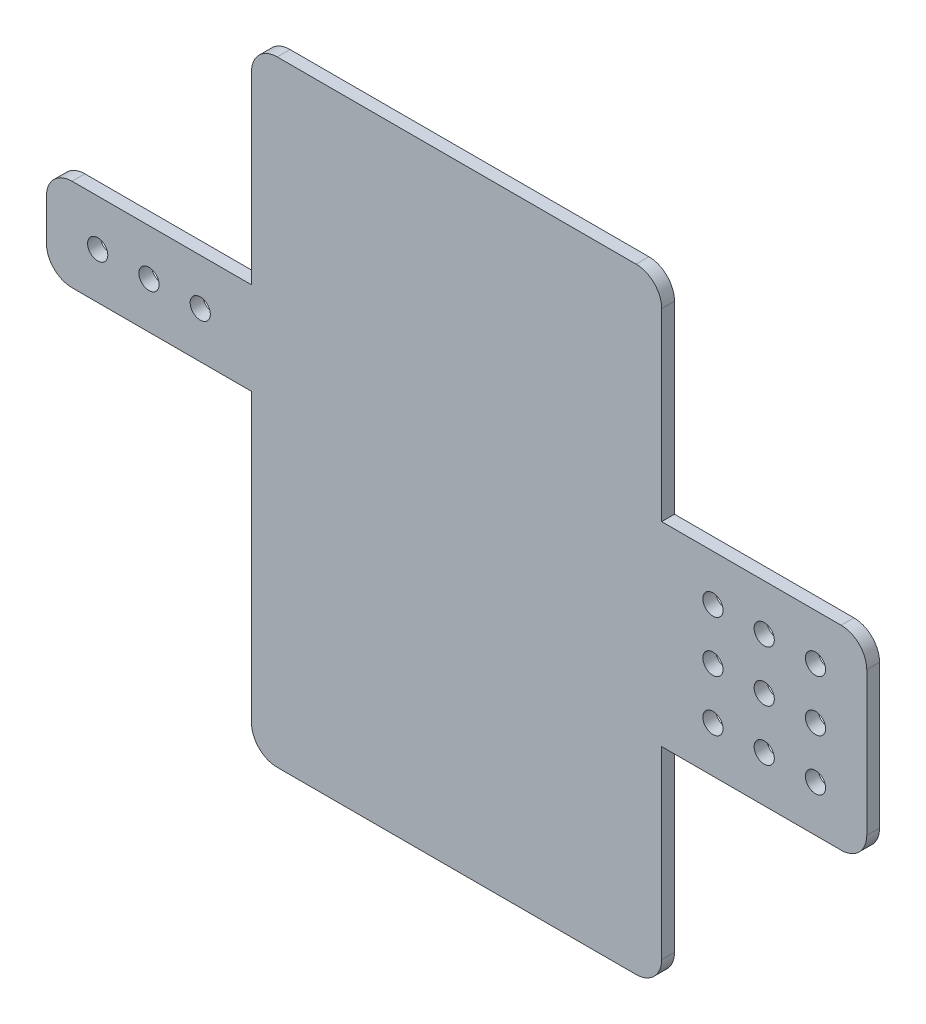
ISO-10303-21;
HEADER;
FILE_DESCRIPTION(('STEP AP214'),'2;1');
FILE_NAME('part.step','',(''),(''),'','','');
FILE_SCHEMA(('AUTOMOTIVE_DESIGN { 1 0 10303 214 1 1 1 1 }'));
ENDSEC;
DATA;
#1=APPLICATION_CONTEXT('core data for automotive mechanical design processes');
#2=APPLICATION_PROTOCOL_DEFINITION('international standard','automotive_design',2000,#1);
#3=PRODUCT_CONTEXT('',#1,'mechanical');
#4=PRODUCT('Part','Part','',(#3));
#5=PRODUCT_RELATED_PRODUCT_CATEGORY('part','',(#4));
#6=PRODUCT_DEFINITION_FORMATION('','',#4);
#7=PRODUCT_DEFINITION_CONTEXT('part definition',#1,'design');
#8=PRODUCT_DEFINITION('design','',#6,#7);
#9=PRODUCT_DEFINITION_SHAPE('','',#8);
#10=(LENGTH_UNIT() NAMED_UNIT(*) SI_UNIT(.MILLI.,.METRE.));
#11=(NAMED_UNIT(*) PLANE_ANGLE_UNIT() SI_UNIT($,.RADIAN.));
#12=(NAMED_UNIT(*) SI_UNIT($,.STERADIAN.) SOLID_ANGLE_UNIT());
#13=UNCERTAINTY_MEASURE_WITH_UNIT(LENGTH_MEASURE(1.E-05),#10,'distance_accuracy_value','');
#14=(GEOMETRIC_REPRESENTATION_CONTEXT(3) GLOBAL_UNCERTAINTY_ASSIGNED_CONTEXT((#13)) GLOBAL_UNIT_ASSIGNED_CONTEXT((#10,
#11,#12)) REPRESENTATION_CONTEXT('',''));
#15=CARTESIAN_POINT('',(0.,0.,0.));
#16=DIRECTION('',(0.,0.,1.));
#17=DIRECTION('',(1.,0.,0.));
#18=AXIS2_PLACEMENT_3D('',#15,#16,#17);
#19=CARTESIAN_POINT('',(0.,25.1030959893067,3.175));
#20=DIRECTION('',(0.,1.,0.));
#21=DIRECTION('',(0.,0.,1.));
#22=AXIS2_PLACEMENT_3D('',#19,#20,#21);
#23=PLANE('',#22);
#24=DIRECTION('',(1.,0.,0.));
#25=VECTOR('',#24,1.);
#26=CARTESIAN_POINT('',(0.,25.1030959893067,0.));
#27=LINE('',#26,#25);
#28=CARTESIAN_POINT('',(-125.176151207656,25.1030959893067,0.));
#29=VERTEX_POINT('',#28);
#30=CARTESIAN_POINT('',(-36.2761512076566,25.1030959893067,0.));
#31=VERTEX_POINT('',#30);
#32=EDGE_CURVE('E354',#29,#31,#27,.T.);
#33=ORIENTED_EDGE('',*,*,#32,.F.);
#34=DIRECTION('',(0.,0.,-1.));
#35=VECTOR('',#34,1.);
#36=CARTESIAN_POINT('',(-125.176151207656,25.1030959893067,3.175));
#37=LINE('',#36,#35);
#38=CARTESIAN_POINT('',(-125.176151207656,25.1030959893067,3.175));
#39=VERTEX_POINT('',#38);
#40=EDGE_CURVE('E11',#39,#29,#37,.T.);
#41=ORIENTED_EDGE('',*,*,#40,.F.);
#42=DIRECTION('',(1.,0.,0.));
#43=VECTOR('',#42,1.);
#44=CARTESIAN_POINT('',(0.,25.1030959893067,3.175));
#45=LINE('',#44,#43);
#46=CARTESIAN_POINT('',(-36.2761512076566,25.1030959893067,3.175));
#47=VERTEX_POINT('',#46);
#48=EDGE_CURVE('E255',#39,#47,#45,.T.);
#49=ORIENTED_EDGE('',*,*,#48,.T.);
#50=DIRECTION('',(0.,0.,-1.));
#51=VECTOR('',#50,1.);
#52=CARTESIAN_POINT('',(-36.2761512076566,25.1030959893067,3.175));
#53=LINE('',#52,#51);
#54=EDGE_CURVE('E58',#47,#31,#53,.T.);
#55=ORIENTED_EDGE('',*,*,#54,.T.);
#56=EDGE_LOOP('',(#33,#41,#49,#55));
#57=FACE_BOUND('',#56,.T.);
#58=ADVANCED_FACE('F41',(#57),#23,.T.);
#59=CARTESIAN_POINT('',(-125.176151207657,18.7530959893067,3.175));
#60=DIRECTION('',(0.,0.,-1.));
#61=DIRECTION('',(-1.,0.,0.));
#62=AXIS2_PLACEMENT_3D('',#59,#60,#61);
#63=CYLINDRICAL_SURFACE('',#62,6.35);
#64=CARTESIAN_POINT('',(-125.176151207657,18.7530959893067,0.));
#65=DIRECTION('',(0.,0.,1.));
#66=DIRECTION('',(1.,0.,0.));
#67=AXIS2_PLACEMENT_3D('',#64,#65,#66);
#68=CIRCLE('',#67,6.35);
#69=CARTESIAN_POINT('',(-131.526151207657,18.7530959893066,0.));
#70=VERTEX_POINT('',#69);
#71=EDGE_CURVE('E358',#29,#70,#68,.T.);
#72=ORIENTED_EDGE('',*,*,#71,.T.);
#73=DIRECTION('',(0.,0.,-1.));
#74=VECTOR('',#73,1.);
#75=CARTESIAN_POINT('',(-131.526151207657,18.7530959893066,3.175));
#76=LINE('',#75,#74);
#77=CARTESIAN_POINT('',(-131.526151207657,18.7530959893066,3.175));
#78=VERTEX_POINT('',#77);
#79=EDGE_CURVE('E50',#78,#70,#76,.T.);
#80=ORIENTED_EDGE('',*,*,#79,.F.);
#81=CARTESIAN_POINT('',(-125.176151207657,18.7530959893067,3.175));
#82=DIRECTION('',(0.,0.,1.));
#83=DIRECTION('',(1.,0.,0.));
#84=AXIS2_PLACEMENT_3D('',#81,#82,#83);
#85=CIRCLE('',#84,6.35);
#86=EDGE_CURVE('E252',#39,#78,#85,.T.);
#87=ORIENTED_EDGE('',*,*,#86,.F.);
#88=ORIENTED_EDGE('',*,*,#40,.T.);
#89=EDGE_LOOP('',(#72,#80,#87,#88));
#90=FACE_BOUND('',#89,.T.);
#91=ADVANCED_FACE('F500',(#90),#63,.T.);
#92=CARTESIAN_POINT('',(-131.526151207657,0.,3.175));
#93=DIRECTION('',(1.,0.,0.));
#94=DIRECTION('',(0.,1.,0.));
#95=AXIS2_PLACEMENT_3D('',#92,#93,#94);
#96=PLANE('',#95);
#97=DIRECTION('',(0.,-1.,0.));
#98=VECTOR('',#97,1.);
#99=CARTESIAN_POINT('',(-131.526151207657,0.,0.));
#100=LINE('',#99,#98);
#101=CARTESIAN_POINT('',(-131.526151207657,-26.9669040106933,0.));
#102=VERTEX_POINT('',#101);
#103=EDGE_CURVE('E364',#70,#102,#100,.T.);
#104=ORIENTED_EDGE('',*,*,#103,.T.);
#105=DIRECTION('',(0.,0.,-1.));
#106=VECTOR('',#105,1.);
#107=CARTESIAN_POINT('',(-131.526151207657,-26.9669040106933,3.175));
#108=LINE('',#107,#106);
#109=CARTESIAN_POINT('',(-131.526151207657,-26.9669040106933,3.175));
#110=VERTEX_POINT('',#109);
#111=EDGE_CURVE('E473',#110,#102,#108,.T.);
#112=ORIENTED_EDGE('',*,*,#111,.F.);
#113=DIRECTION('',(0.,-1.,0.));
#114=VECTOR('',#113,1.);
#115=CARTESIAN_POINT('',(-131.526151207657,0.,3.175));
#116=LINE('',#115,#114);
#117=EDGE_CURVE('E249',#78,#110,#116,.T.);
#118=ORIENTED_EDGE('',*,*,#117,.F.);
#119=ORIENTED_EDGE('',*,*,#79,.T.);
#120=EDGE_LOOP('',(#104,#112,#118,#119));
#121=FACE_BOUND('',#120,.T.);
#122=ADVANCED_FACE('F482',(#121),#96,.F.);
#123=CARTESIAN_POINT('',(0.,-26.9669040106933,3.175));
#124=DIRECTION('',(0.,-1.,0.));
#125=DIRECTION('',(1.,0.,0.));
#126=AXIS2_PLACEMENT_3D('',#123,#124,#125);
#127=PLANE('',#126);
#128=DIRECTION('',(-1.,0.,0.));
#129=VECTOR('',#128,1.);
#130=CARTESIAN_POINT('',(0.,-26.9669040106933,0.));
#131=LINE('',#130,#129);
#132=CARTESIAN_POINT('',(-175.976151207657,-26.9669040106933,0.));
#133=VERTEX_POINT('',#132);
#134=EDGE_CURVE('E369',#102,#133,#131,.T.);
#135=ORIENTED_EDGE('',*,*,#134,.T.);
#136=DIRECTION('',(0.,0.,-1.));
#137=VECTOR('',#136,1.);
#138=CARTESIAN_POINT('',(-175.976151207657,-26.9669040106933,3.175));
#139=LINE('',#138,#137);
#140=CARTESIAN_POINT('',(-175.976151207657,-26.9669040106933,3.175));
#141=VERTEX_POINT('',#140);
#142=EDGE_CURVE('E469',#141,#133,#139,.T.);
#143=ORIENTED_EDGE('',*,*,#142,.F.);
#144=DIRECTION('',(-1.,0.,0.));
#145=VECTOR('',#144,1.);
#146=CARTESIAN_POINT('',(0.,-26.9669040106933,3.175));
#147=LINE('',#146,#145);
#148=EDGE_CURVE('E246',#110,#141,#147,.T.);
#149=ORIENTED_EDGE('',*,*,#148,.F.);
#150=ORIENTED_EDGE('',*,*,#111,.T.);
#151=EDGE_LOOP('',(#135,#143,#149,#150));
#152=FACE_BOUND('',#151,.T.);
#153=ADVANCED_FACE('F491',(#152),#127,.F.);
#154=CARTESIAN_POINT('',(-175.976151207657,-33.3169040106933,3.175));
#155=DIRECTION('',(0.,0.,-1.));
#156=DIRECTION('',(-1.,0.,0.));
#157=AXIS2_PLACEMENT_3D('',#154,#155,#156);
#158=CYLINDRICAL_SURFACE('',#157,6.35);
#159=CARTESIAN_POINT('',(-175.976151207657,-33.3169040106933,0.));
#160=DIRECTION('',(0.,0.,1.));
#161=DIRECTION('',(1.,0.,0.));
#162=AXIS2_PLACEMENT_3D('',#159,#160,#161);
#163=CIRCLE('',#162,6.35);
#164=CARTESIAN_POINT('',(-182.326151207657,-33.3169040106933,0.));
#165=VERTEX_POINT('',#164);
#166=EDGE_CURVE('E373',#133,#165,#163,.T.);
#167=ORIENTED_EDGE('',*,*,#166,.T.);
#168=DIRECTION('',(0.,0.,-1.));
#169=VECTOR('',#168,1.);
#170=CARTESIAN_POINT('',(-182.326151207657,-33.3169040106933,3.175));
#171=LINE('',#170,#169);
#172=CARTESIAN_POINT('',(-182.326151207657,-33.3169040106933,3.175));
#173=VERTEX_POINT('',#172);
#174=EDGE_CURVE('E465',#173,#165,#171,.T.);
#175=ORIENTED_EDGE('',*,*,#174,.F.);
#176=CARTESIAN_POINT('',(-175.976151207657,-33.3169040106933,3.175));
#177=DIRECTION('',(0.,0.,1.));
#178=DIRECTION('',(1.,0.,0.));
#179=AXIS2_PLACEMENT_3D('',#176,#177,#178);
#180=CIRCLE('',#179,6.35);
#181=EDGE_CURVE('E243',#141,#173,#180,.T.);
#182=ORIENTED_EDGE('',*,*,#181,.F.);
#183=ORIENTED_EDGE('',*,*,#142,.T.);
#184=EDGE_LOOP('',(#167,#175,#182,#183));
#185=FACE_BOUND('',#184,.T.);
#186=ADVANCED_FACE('F495',(#185),#158,.T.);
#187=CARTESIAN_POINT('',(-182.326151207657,-4.98087330369164E-13,3.175));
#188=DIRECTION('',(1.,0.,0.));
#189=DIRECTION('',(0.,1.,0.));
#190=AXIS2_PLACEMENT_3D('',#187,#188,#189);
#191=PLANE('',#190);
#192=DIRECTION('',(0.,-1.,0.));
#193=VECTOR('',#192,1.);
#194=CARTESIAN_POINT('',(-182.326151207657,-4.98087330369164E-13,0.));
#195=LINE('',#194,#193);
#196=CARTESIAN_POINT('',(-182.326151207656,-43.4769040106933,0.));
#197=VERTEX_POINT('',#196);
#198=EDGE_CURVE('E376',#165,#197,#195,.T.);
#199=ORIENTED_EDGE('',*,*,#198,.T.);
#200=DIRECTION('',(0.,0.,-1.));
#201=VECTOR('',#200,1.);
#202=CARTESIAN_POINT('',(-182.326151207656,-43.4769040106933,3.175));
#203=LINE('',#202,#201);
#204=CARTESIAN_POINT('',(-182.326151207656,-43.4769040106933,3.175));
#205=VERTEX_POINT('',#204);
#206=EDGE_CURVE('E462',#205,#197,#203,.T.);
#207=ORIENTED_EDGE('',*,*,#206,.F.);
#208=DIRECTION('',(0.,-1.,0.));
#209=VECTOR('',#208,1.);
#210=CARTESIAN_POINT('',(-182.326151207657,-4.98087330369164E-13,3.175));
#211=LINE('',#210,#209);
#212=EDGE_CURVE('E240',#173,#205,#211,.T.);
#213=ORIENTED_EDGE('',*,*,#212,.F.);
#214=ORIENTED_EDGE('',*,*,#174,.T.);
#215=EDGE_LOOP('',(#199,#207,#213,#214));
#216=FACE_BOUND('',#215,.T.);
#217=ADVANCED_FACE('F513',(#216),#191,.F.);
#218=CARTESIAN_POINT('',(-175.976151207657,-43.4769040106933,3.175));
#219=DIRECTION('',(0.,0.,-1.));
#220=DIRECTION('',(-1.,0.,0.));
#221=AXIS2_PLACEMENT_3D('',#218,#219,#220);
#222=CYLINDRICAL_SURFACE('',#221,6.34999999999999);
#223=CARTESIAN_POINT('',(-175.976151207657,-43.4769040106933,0.));
#224=DIRECTION('',(0.,0.,1.));
#225=DIRECTION('',(1.,0.,0.));
#226=AXIS2_PLACEMENT_3D('',#223,#224,#225);
#227=CIRCLE('',#226,6.34999999999999);
#228=CARTESIAN_POINT('',(-175.976151207657,-49.8269040106933,0.));
#229=VERTEX_POINT('',#228);
#230=EDGE_CURVE('E380',#229,#197,#227,.F.);
#231=ORIENTED_EDGE('',*,*,#230,.F.);
#232=DIRECTION('',(0.,0.,-1.));
#233=VECTOR('',#232,1.);
#234=CARTESIAN_POINT('',(-175.976151207657,-49.8269040106933,3.175));
#235=LINE('',#234,#233);
#236=CARTESIAN_POINT('',(-175.976151207657,-49.8269040106933,3.175));
#237=VERTEX_POINT('',#236);
#238=EDGE_CURVE('E459',#237,#229,#235,.T.);
#239=ORIENTED_EDGE('',*,*,#238,.F.);
#240=CARTESIAN_POINT('',(-175.976151207657,-43.4769040106933,3.175));
#241=DIRECTION('',(0.,0.,1.));
#242=DIRECTION('',(1.,0.,0.));
#243=AXIS2_PLACEMENT_3D('',#240,#241,#242);
#244=CIRCLE('',#243,6.34999999999999);
#245=EDGE_CURVE('E236',#237,#205,#244,.F.);
#246=ORIENTED_EDGE('',*,*,#245,.T.);
#247=ORIENTED_EDGE('',*,*,#206,.T.);
#248=EDGE_LOOP('',(#231,#239,#246,#247));
#249=FACE_BOUND('',#248,.T.);
#250=ADVANCED_FACE('F516',(#249),#222,.T.);
#251=CARTESIAN_POINT('',(0.,-49.8269040106933,3.175));
#252=DIRECTION('',(0.,-1.,0.));
#253=DIRECTION('',(1.,0.,0.));
#254=AXIS2_PLACEMENT_3D('',#251,#252,#253);
#255=PLANE('',#254);
#256=DIRECTION('',(-1.,0.,0.));
#257=VECTOR('',#256,1.);
#258=CARTESIAN_POINT('',(0.,-49.8269040106933,0.));
#259=LINE('',#258,#257);
#260=CARTESIAN_POINT('',(-131.526151207657,-49.8269040106933,0.));
#261=VERTEX_POINT('',#260);
#262=EDGE_CURVE('E384',#261,#229,#259,.T.);
#263=ORIENTED_EDGE('',*,*,#262,.F.);
#264=DIRECTION('',(0.,0.,-1.));
#265=VECTOR('',#264,1.);
#266=CARTESIAN_POINT('',(-131.526151207657,-49.8269040106933,3.175));
#267=LINE('',#266,#265);
#268=CARTESIAN_POINT('',(-131.526151207657,-49.8269040106933,3.175));
#269=VERTEX_POINT('',#268);
#270=EDGE_CURVE('E456',#269,#261,#267,.T.);
#271=ORIENTED_EDGE('',*,*,#270,.F.);
#272=DIRECTION('',(-1.,0.,0.));
#273=VECTOR('',#272,1.);
#274=CARTESIAN_POINT('',(0.,-49.8269040106933,3.175));
#275=LINE('',#274,#273);
#276=EDGE_CURVE('E232',#269,#237,#275,.T.);
#277=ORIENTED_EDGE('',*,*,#276,.T.);
#278=ORIENTED_EDGE('',*,*,#238,.T.);
#279=EDGE_LOOP('',(#263,#271,#277,#278));
#280=FACE_BOUND('',#279,.T.);
#281=ADVANCED_FACE('F520',(#280),#255,.T.);
#282=CARTESIAN_POINT('',(-131.526151207657,-120.946904010693,0.));
#283=VERTEX_POINT('',#282);
#284=EDGE_CURVE('E370',#261,#283,#100,.T.);
#285=ORIENTED_EDGE('',*,*,#284,.T.);
#286=DIRECTION('',(0.,0.,-1.));
#287=VECTOR('',#286,1.);
#288=CARTESIAN_POINT('',(-131.526151207657,-120.946904010693,3.175));
#289=LINE('',#288,#287);
#290=CARTESIAN_POINT('',(-131.526151207657,-120.946904010693,3.175));
#291=VERTEX_POINT('',#290);
#292=EDGE_CURVE('E452',#291,#283,#289,.T.);
#293=ORIENTED_EDGE('',*,*,#292,.F.);
#294=EDGE_CURVE('E231',#269,#291,#116,.T.);
#295=ORIENTED_EDGE('',*,*,#294,.F.);
#296=ORIENTED_EDGE('',*,*,#270,.T.);
#297=EDGE_LOOP('',(#285,#293,#295,#296));
#298=FACE_BOUND('',#297,.T.);
#299=ADVANCED_FACE('F507',(#298),#96,.F.);
#300=CARTESIAN_POINT('',(-125.176151207657,-120.946904010693,3.175));
#301=DIRECTION('',(0.,0.,-1.));
#302=DIRECTION('',(-1.,0.,0.));
#303=AXIS2_PLACEMENT_3D('',#300,#301,#302);
#304=CYLINDRICAL_SURFACE('',#303,6.34999999999999);
#305=CARTESIAN_POINT('',(-125.176151207657,-120.946904010693,0.));
#306=DIRECTION('',(0.,0.,1.));
#307=DIRECTION('',(1.,0.,0.));
#308=AXIS2_PLACEMENT_3D('',#305,#306,#307);
#309=CIRCLE('',#308,6.34999999999999);
#310=CARTESIAN_POINT('',(-125.176151207656,-127.296904010693,0.));
#311=VERTEX_POINT('',#310);
#312=EDGE_CURVE('E388',#283,#311,#309,.T.);
#313=ORIENTED_EDGE('',*,*,#312,.T.);
#314=DIRECTION('',(0.,0.,-1.));
#315=VECTOR('',#314,1.);
#316=CARTESIAN_POINT('',(-125.176151207656,-127.296904010693,3.175));
#317=LINE('',#316,#315);
#318=CARTESIAN_POINT('',(-125.176151207656,-127.296904010693,3.175));
#319=VERTEX_POINT('',#318);
#320=EDGE_CURVE('E448',#319,#311,#317,.T.);
#321=ORIENTED_EDGE('',*,*,#320,.F.);
#322=CARTESIAN_POINT('',(-125.176151207657,-120.946904010693,3.175));
#323=DIRECTION('',(0.,0.,1.));
#324=DIRECTION('',(1.,0.,0.));
#325=AXIS2_PLACEMENT_3D('',#322,#323,#324);
#326=CIRCLE('',#325,6.34999999999999);
#327=EDGE_CURVE('E226',#291,#319,#326,.T.);
#328=ORIENTED_EDGE('',*,*,#327,.F.);
#329=ORIENTED_EDGE('',*,*,#292,.T.);
#330=EDGE_LOOP('',(#313,#321,#328,#329));
#331=FACE_BOUND('',#330,.T.);
#332=ADVANCED_FACE('F526',(#331),#304,.T.);
#333=CARTESIAN_POINT('',(0.,-127.296904010693,3.175));
#334=DIRECTION('',(0.,1.,0.));
#335=DIRECTION('',(0.,0.,1.));
#336=AXIS2_PLACEMENT_3D('',#333,#334,#335);
#337=PLANE('',#336);
#338=DIRECTION('',(1.,0.,0.));
#339=VECTOR('',#338,1.);
#340=CARTESIAN_POINT('',(0.,-127.296904010693,0.));
#341=LINE('',#340,#339);
#342=CARTESIAN_POINT('',(-36.2761512076566,-127.296904010693,0.));
#343=VERTEX_POINT('',#342);
#344=EDGE_CURVE('E391',#311,#343,#341,.T.);
#345=ORIENTED_EDGE('',*,*,#344,.T.);
#346=DIRECTION('',(0.,0.,-1.));
#347=VECTOR('',#346,1.);
#348=CARTESIAN_POINT('',(-36.2761512076566,-127.296904010693,3.175));
#349=LINE('',#348,#347);
#350=CARTESIAN_POINT('',(-36.2761512076566,-127.296904010693,3.175));
#351=VERTEX_POINT('',#350);
#352=EDGE_CURVE('E444',#351,#343,#349,.T.);
#353=ORIENTED_EDGE('',*,*,#352,.F.);
#354=DIRECTION('',(1.,0.,0.));
#355=VECTOR('',#354,1.);
#356=CARTESIAN_POINT('',(0.,-127.296904010693,3.175));
#357=LINE('',#356,#355);
#358=EDGE_CURVE('E222',#319,#351,#357,.T.);
#359=ORIENTED_EDGE('',*,*,#358,.F.);
#360=ORIENTED_EDGE('',*,*,#320,.T.);
#361=EDGE_LOOP('',(#345,#353,#359,#360));
#362=FACE_BOUND('',#361,.T.);
#363=ADVANCED_FACE('F530',(#362),#337,.F.);
#364=CARTESIAN_POINT('',(-36.2761512076565,-120.946904010693,3.175));
#365=DIRECTION('',(0.,0.,-1.));
#366=DIRECTION('',(-1.,0.,0.));
#367=AXIS2_PLACEMENT_3D('',#364,#365,#366);
#368=CYLINDRICAL_SURFACE('',#367,6.35);
#369=CARTESIAN_POINT('',(-36.2761512076565,-120.946904010693,0.));
#370=DIRECTION('',(0.,0.,1.));
#371=DIRECTION('',(1.,0.,0.));
#372=AXIS2_PLACEMENT_3D('',#369,#370,#371);
#373=CIRCLE('',#372,6.35);
#374=CARTESIAN_POINT('',(-29.9261512076565,-120.946904010693,0.));
#375=VERTEX_POINT('',#374);
#376=EDGE_CURVE('E394',#343,#375,#373,.T.);
#377=ORIENTED_EDGE('',*,*,#376,.T.);
#378=DIRECTION('',(0.,0.,-1.));
#379=VECTOR('',#378,1.);
#380=CARTESIAN_POINT('',(-29.9261512076565,-120.946904010693,3.175));
#381=LINE('',#380,#379);
#382=CARTESIAN_POINT('',(-29.9261512076565,-120.946904010693,3.175));
#383=VERTEX_POINT('',#382);
#384=EDGE_CURVE('E441',#383,#375,#381,.T.);
#385=ORIENTED_EDGE('',*,*,#384,.F.);
#386=CARTESIAN_POINT('',(-36.2761512076565,-120.946904010693,3.175));
#387=DIRECTION('',(0.,0.,1.));
#388=DIRECTION('',(1.,0.,0.));
#389=AXIS2_PLACEMENT_3D('',#386,#387,#388);
#390=CIRCLE('',#389,6.35);
#391=EDGE_CURVE('E216',#351,#383,#390,.T.);
#392=ORIENTED_EDGE('',*,*,#391,.F.);
#393=ORIENTED_EDGE('',*,*,#352,.T.);
#394=EDGE_LOOP('',(#377,#385,#392,#393));
#395=FACE_BOUND('',#394,.T.);
#396=ADVANCED_FACE('F534',(#395),#368,.T.);
#397=CARTESIAN_POINT('',(-29.9261512076565,0.,3.175));
#398=DIRECTION('',(1.,0.,0.));
#399=DIRECTION('',(0.,1.,0.));
#400=AXIS2_PLACEMENT_3D('',#397,#398,#399);
#401=PLANE('',#400);
#402=DIRECTION('',(0.,-1.,0.));
#403=VECTOR('',#402,1.);
#404=CARTESIAN_POINT('',(-29.9261512076565,0.,0.));
#405=LINE('',#404,#403);
#406=CARTESIAN_POINT('',(-29.9261512076565,-75.2269040106933,0.));
#407=VERTEX_POINT('',#406);
#408=EDGE_CURVE('E398',#407,#375,#405,.T.);
#409=ORIENTED_EDGE('',*,*,#408,.F.);
#410=DIRECTION('',(0.,0.,-1.));
#411=VECTOR('',#410,1.);
#412=CARTESIAN_POINT('',(-29.9261512076565,-75.2269040106933,3.175));
#413=LINE('',#412,#411);
#414=CARTESIAN_POINT('',(-29.9261512076565,-75.2269040106933,3.175));
#415=VERTEX_POINT('',#414);
#416=EDGE_CURVE('E438',#415,#407,#413,.T.);
#417=ORIENTED_EDGE('',*,*,#416,.F.);
#418=DIRECTION('',(0.,-1.,0.));
#419=VECTOR('',#418,1.);
#420=CARTESIAN_POINT('',(-29.9261512076565,0.,3.175));
#421=LINE('',#420,#419);
#422=EDGE_CURVE('E208',#415,#383,#421,.T.);
#423=ORIENTED_EDGE('',*,*,#422,.T.);
#424=ORIENTED_EDGE('',*,*,#384,.T.);
#425=EDGE_LOOP('',(#409,#417,#423,#424));
#426=FACE_BOUND('',#425,.T.);
#427=ADVANCED_FACE('F538',(#426),#401,.T.);
#428=CARTESIAN_POINT('',(0.,-75.2269040106933,3.175));
#429=DIRECTION('',(0.,1.,0.));
#430=DIRECTION('',(0.,0.,1.));
#431=AXIS2_PLACEMENT_3D('',#428,#429,#430);
#432=PLANE('',#431);
#433=DIRECTION('',(1.,0.,0.));
#434=VECTOR('',#433,1.);
#435=CARTESIAN_POINT('',(0.,-75.2269040106933,0.));
#436=LINE('',#435,#434);
#437=CARTESIAN_POINT('',(14.5238487923435,-75.2269040106933,0.));
#438=VERTEX_POINT('',#437);
#439=EDGE_CURVE('E402',#407,#438,#436,.T.);
#440=ORIENTED_EDGE('',*,*,#439,.T.);
#441=DIRECTION('',(0.,0.,-1.));
#442=VECTOR('',#441,1.);
#443=CARTESIAN_POINT('',(14.5238487923435,-75.2269040106933,3.175));
#444=LINE('',#443,#442);
#445=CARTESIAN_POINT('',(14.5238487923435,-75.2269040106933,3.175));
#446=VERTEX_POINT('',#445);
#447=EDGE_CURVE('E434',#446,#438,#444,.T.);
#448=ORIENTED_EDGE('',*,*,#447,.F.);
#449=DIRECTION('',(1.,0.,0.));
#450=VECTOR('',#449,1.);
#451=CARTESIAN_POINT('',(0.,-75.2269040106933,3.175));
#452=LINE('',#451,#450);
#453=EDGE_CURVE('E215',#415,#446,#452,.T.);
#454=ORIENTED_EDGE('',*,*,#453,.F.);
#455=ORIENTED_EDGE('',*,*,#416,.T.);
#456=EDGE_LOOP('',(#440,#448,#454,#455));
#457=FACE_BOUND('',#456,.T.);
#458=ADVANCED_FACE('F540',(#457),#432,.F.);
#459=CARTESIAN_POINT('',(14.5238487923435,-68.8769040106933,3.175));
#460=DIRECTION('',(0.,0.,-1.));
#461=DIRECTION('',(-1.,0.,0.));
#462=AXIS2_PLACEMENT_3D('',#459,#460,#461);
#463=CYLINDRICAL_SURFACE('',#462,6.34999999999999);
#464=CARTESIAN_POINT('',(14.5238487923435,-68.8769040106933,0.));
#465=DIRECTION('',(0.,0.,1.));
#466=DIRECTION('',(1.,0.,0.));
#467=AXIS2_PLACEMENT_3D('',#464,#465,#466);
#468=CIRCLE('',#467,6.34999999999999);
#469=CARTESIAN_POINT('',(20.8738487923435,-68.8769040106933,0.));
#470=VERTEX_POINT('',#469);
#471=EDGE_CURVE('E406',#438,#470,#468,.T.);
#472=ORIENTED_EDGE('',*,*,#471,.T.);
#473=DIRECTION('',(0.,0.,-1.));
#474=VECTOR('',#473,1.);
#475=CARTESIAN_POINT('',(20.8738487923435,-68.8769040106933,3.175));
#476=LINE('',#475,#474);
#477=CARTESIAN_POINT('',(20.8738487923435,-68.8769040106933,3.175));
#478=VERTEX_POINT('',#477);
#479=EDGE_CURVE('E431',#478,#470,#476,.T.);
#480=ORIENTED_EDGE('',*,*,#479,.F.);
#481=CARTESIAN_POINT('',(14.5238487923435,-68.8769040106933,3.175));
#482=DIRECTION('',(0.,0.,1.));
#483=DIRECTION('',(1.,0.,0.));
#484=AXIS2_PLACEMENT_3D('',#481,#482,#483);
#485=CIRCLE('',#484,6.34999999999999);
#486=EDGE_CURVE('E221',#446,#478,#485,.T.);
#487=ORIENTED_EDGE('',*,*,#486,.F.);
#488=ORIENTED_EDGE('',*,*,#447,.T.);
#489=EDGE_LOOP('',(#472,#480,#487,#488));
#490=FACE_BOUND('',#489,.T.);
#491=ADVANCED_FACE('F543',(#490),#463,.T.);
#492=CARTESIAN_POINT('',(20.8738487923435,0.,3.175));
#493=DIRECTION('',(1.,0.,0.));
#494=DIRECTION('',(0.,0.,-1.));
#495=AXIS2_PLACEMENT_3D('',#492,#493,#494);
#496=PLANE('',#495);
#497=DIRECTION('',(0.,-1.,0.));
#498=VECTOR('',#497,1.);
#499=CARTESIAN_POINT('',(20.8738487923435,0.,0.));
#500=LINE('',#499,#498);
#501=CARTESIAN_POINT('',(20.8738487923435,-33.3169040106933,0.));
#502=VERTEX_POINT('',#501);
#503=EDGE_CURVE('E410',#502,#470,#500,.T.);
#504=ORIENTED_EDGE('',*,*,#503,.F.);
#505=DIRECTION('',(0.,0.,-1.));
#506=VECTOR('',#505,1.);
#507=CARTESIAN_POINT('',(20.8738487923435,-33.3169040106933,3.175));
#508=LINE('',#507,#506);
#509=CARTESIAN_POINT('',(20.8738487923435,-33.3169040106933,3.175));
#510=VERTEX_POINT('',#509);
#511=EDGE_CURVE('E428',#510,#502,#508,.T.);
#512=ORIENTED_EDGE('',*,*,#511,.F.);
#513=DIRECTION('',(0.,-1.,0.));
#514=VECTOR('',#513,1.);
#515=CARTESIAN_POINT('',(20.8738487923435,0.,3.175));
#516=LINE('',#515,#514);
#517=EDGE_CURVE('E888',#510,#478,#516,.T.);
#518=ORIENTED_EDGE('',*,*,#517,.T.);
#519=ORIENTED_EDGE('',*,*,#479,.T.);
#520=EDGE_LOOP('',(#504,#512,#518,#519));
#521=FACE_BOUND('',#520,.T.);
#522=ADVANCED_FACE('F547',(#521),#496,.T.);
#523=CARTESIAN_POINT('',(14.5238487923435,-33.3169040106933,3.175));
#524=DIRECTION('',(0.,0.,-1.));
#525=DIRECTION('',(-1.,0.,0.));
#526=AXIS2_PLACEMENT_3D('',#523,#524,#525);
#527=CYLINDRICAL_SURFACE('',#526,6.35);
#528=CARTESIAN_POINT('',(14.5238487923435,-33.3169040106933,0.));
#529=DIRECTION('',(0.,0.,1.));
#530=DIRECTION('',(1.,0.,0.));
#531=AXIS2_PLACEMENT_3D('',#528,#529,#530);
#532=CIRCLE('',#531,6.35);
#533=CARTESIAN_POINT('',(14.5238487923435,-26.9669040106933,0.));
#534=VERTEX_POINT('',#533);
#535=EDGE_CURVE('E414',#534,#502,#532,.F.);
#536=ORIENTED_EDGE('',*,*,#535,.F.);
#537=DIRECTION('',(0.,0.,-1.));
#538=VECTOR('',#537,1.);
#539=CARTESIAN_POINT('',(14.5238487923435,-26.9669040106933,3.175));
#540=LINE('',#539,#538);
#541=CARTESIAN_POINT('',(14.5238487923435,-26.9669040106933,3.175));
#542=VERTEX_POINT('',#541);
#543=EDGE_CURVE('E190',#542,#534,#540,.T.);
#544=ORIENTED_EDGE('',*,*,#543,.F.);
#545=CARTESIAN_POINT('',(14.5238487923435,-33.3169040106933,3.175));
#546=DIRECTION('',(0.,0.,1.));
#547=DIRECTION('',(1.,0.,0.));
#548=AXIS2_PLACEMENT_3D('',#545,#546,#547);
#549=CIRCLE('',#548,6.35);
#550=EDGE_CURVE('E201',#542,#510,#549,.F.);
#551=ORIENTED_EDGE('',*,*,#550,.T.);
#552=ORIENTED_EDGE('',*,*,#511,.T.);
#553=EDGE_LOOP('',(#536,#544,#551,#552));
#554=FACE_BOUND('',#553,.T.);
#555=ADVANCED_FACE('F551',(#554),#527,.T.);
#556=CARTESIAN_POINT('',(0.,-26.9669040106933,3.175));
#557=DIRECTION('',(0.,1.,0.));
#558=DIRECTION('',(0.,0.,1.));
#559=AXIS2_PLACEMENT_3D('',#556,#557,#558);
#560=PLANE('',#559);
#561=DIRECTION('',(1.,0.,0.));
#562=VECTOR('',#561,1.);
#563=CARTESIAN_POINT('',(0.,-26.9669040106933,0.));
#564=LINE('',#563,#562);
#565=CARTESIAN_POINT('',(-29.9261512076565,-26.9669040106933,0.));
#566=VERTEX_POINT('',#565);
#567=EDGE_CURVE('E185',#566,#534,#564,.T.);
#568=ORIENTED_EDGE('',*,*,#567,.F.);
#569=DIRECTION('',(0.,0.,-1.));
#570=VECTOR('',#569,1.);
#571=CARTESIAN_POINT('',(-29.9261512076565,-26.9669040106933,3.175));
#572=LINE('',#571,#570);
#573=CARTESIAN_POINT('',(-29.9261512076565,-26.9669040106933,3.175));
#574=VERTEX_POINT('',#573);
#575=EDGE_CURVE('E180',#574,#566,#572,.T.);
#576=ORIENTED_EDGE('',*,*,#575,.F.);
#577=DIRECTION('',(1.,0.,0.));
#578=VECTOR('',#577,1.);
#579=CARTESIAN_POINT('',(0.,-26.9669040106933,3.175));
#580=LINE('',#579,#578);
#581=EDGE_CURVE('E183',#574,#542,#580,.T.);
#582=ORIENTED_EDGE('',*,*,#581,.T.);
#583=ORIENTED_EDGE('',*,*,#543,.T.);
#584=EDGE_LOOP('',(#568,#576,#582,#583));
#585=FACE_BOUND('',#584,.T.);
#586=ADVANCED_FACE('F182',(#585),#560,.T.);
#587=CARTESIAN_POINT('',(-29.9261512076565,18.7530959893066,0.));
#588=VERTEX_POINT('',#587);
#589=EDGE_CURVE('E403',#588,#566,#405,.T.);
#590=ORIENTED_EDGE('',*,*,#589,.F.);
#591=DIRECTION('',(0.,0.,-1.));
#592=VECTOR('',#591,1.);
#593=CARTESIAN_POINT('',(-29.9261512076565,18.7530959893066,3.175));
#594=LINE('',#593,#592);
#595=CARTESIAN_POINT('',(-29.9261512076565,18.7530959893066,3.175));
#596=VERTEX_POINT('',#595);
#597=EDGE_CURVE('E119',#596,#588,#594,.T.);
#598=ORIENTED_EDGE('',*,*,#597,.F.);
#599=EDGE_CURVE('E198',#596,#574,#421,.T.);
#600=ORIENTED_EDGE('',*,*,#599,.T.);
#601=ORIENTED_EDGE('',*,*,#575,.T.);
#602=EDGE_LOOP('',(#590,#598,#600,#601));
#603=FACE_BOUND('',#602,.T.);
#604=ADVANCED_FACE('F204',(#603),#401,.T.);
#605=CARTESIAN_POINT('',(-36.2761512076565,18.7530959893067,3.175));
#606=DIRECTION('',(0.,0.,-1.));
#607=DIRECTION('',(-1.,0.,0.));
#608=AXIS2_PLACEMENT_3D('',#605,#606,#607);
#609=CYLINDRICAL_SURFACE('',#608,6.35);
#610=CARTESIAN_POINT('',(-36.2761512076565,18.7530959893067,0.));
#611=DIRECTION('',(0.,0.,1.));
#612=DIRECTION('',(1.,0.,0.));
#613=AXIS2_PLACEMENT_3D('',#610,#611,#612);
#614=CIRCLE('',#613,6.35);
#615=EDGE_CURVE('E258',#31,#588,#614,.F.);
#616=ORIENTED_EDGE('',*,*,#615,.F.);
#617=ORIENTED_EDGE('',*,*,#54,.F.);
#618=CARTESIAN_POINT('',(-36.2761512076565,18.7530959893067,3.175));
#619=DIRECTION('',(0.,0.,1.));
#620=DIRECTION('',(1.,0.,0.));
#621=AXIS2_PLACEMENT_3D('',#618,#619,#620);
#622=CIRCLE('',#621,6.35);
#623=EDGE_CURVE('E206',#47,#596,#622,.F.);
#624=ORIENTED_EDGE('',*,*,#623,.T.);
#625=ORIENTED_EDGE('',*,*,#597,.T.);
#626=EDGE_LOOP('',(#616,#617,#624,#625));
#627=FACE_BOUND('',#626,.T.);
#628=ADVANCED_FACE('F560',(#627),#609,.T.);
#629=CARTESIAN_POINT('',(0.,0.,3.175));
#630=DIRECTION('',(0.,0.,1.));
#631=DIRECTION('',(1.,0.,0.));
#632=AXIS2_PLACEMENT_3D('',#629,#630,#631);
#633=PLANE('',#632);
#634=CARTESIAN_POINT('',(-169.626151207657,-38.3969040106933,3.175));
#635=DIRECTION('',(0.,0.,1.));
#636=DIRECTION('',(1.,0.,0.));
#637=AXIS2_PLACEMENT_3D('',#634,#635,#636);
#638=CIRCLE('',#637,2.5);
#639=CARTESIAN_POINT('',(-167.126151207657,-38.3969040106933,3.175));
#640=VERTEX_POINT('',#639);
#641=EDGE_CURVE('E276',#640,#640,#638,.T.);
#642=ORIENTED_EDGE('',*,*,#641,.F.);
#643=EDGE_LOOP('',(#642));
#644=FACE_BOUND('',#643,.T.);
#645=CARTESIAN_POINT('',(-17.2261512076566,-38.3969040106935,3.175));
#646=DIRECTION('',(0.,0.,1.));
#647=DIRECTION('',(1.,0.,0.));
#648=AXIS2_PLACEMENT_3D('',#645,#646,#647);
#649=CIRCLE('',#648,2.5);
#650=CARTESIAN_POINT('',(-14.7261512076566,-38.3969040106935,3.175));
#651=VERTEX_POINT('',#650);
#652=EDGE_CURVE('E334',#651,#651,#649,.T.);
#653=ORIENTED_EDGE('',*,*,#652,.F.);
#654=EDGE_LOOP('',(#653));
#655=FACE_BOUND('',#654,.T.);
#656=CARTESIAN_POINT('',(8.17384879234343,-51.0969040106933,3.175));
#657=DIRECTION('',(0.,0.,1.));
#658=DIRECTION('',(1.,0.,0.));
#659=AXIS2_PLACEMENT_3D('',#656,#657,#658);
#660=CIRCLE('',#659,2.5);
#661=CARTESIAN_POINT('',(10.6738487923434,-51.0969040106933,3.175));
#662=VERTEX_POINT('',#661);
#663=EDGE_CURVE('E325',#662,#662,#660,.T.);
#664=ORIENTED_EDGE('',*,*,#663,.F.);
#665=EDGE_LOOP('',(#664));
#666=FACE_BOUND('',#665,.T.);
#667=CARTESIAN_POINT('',(8.17384879234339,-38.3969040106933,3.175));
#668=DIRECTION('',(0.,0.,1.));
#669=DIRECTION('',(1.,0.,0.));
#670=AXIS2_PLACEMENT_3D('',#667,#668,#669);
#671=CIRCLE('',#670,2.5);
#672=CARTESIAN_POINT('',(10.6738487923434,-38.3969040106933,3.175));
#673=VERTEX_POINT('',#672);
#674=EDGE_CURVE('E341',#673,#673,#671,.T.);
#675=ORIENTED_EDGE('',*,*,#674,.F.);
#676=EDGE_LOOP('',(#675));
#677=FACE_BOUND('',#676,.T.);
#678=CARTESIAN_POINT('',(-4.52615120765653,-63.7969040106934,3.175));
#679=DIRECTION('',(0.,0.,1.));
#680=DIRECTION('',(1.,0.,0.));
#681=AXIS2_PLACEMENT_3D('',#678,#679,#680);
#682=CIRCLE('',#681,2.5);
#683=CARTESIAN_POINT('',(-2.02615120765652,-63.7969040106934,3.175));
#684=VERTEX_POINT('',#683);
#685=EDGE_CURVE('E277',#684,#684,#682,.T.);
#686=ORIENTED_EDGE('',*,*,#685,.F.);
#687=EDGE_LOOP('',(#686));
#688=FACE_BOUND('',#687,.T.);
#689=CARTESIAN_POINT('',(-144.226151207657,-38.3969040106933,3.175));
#690=DIRECTION('',(0.,0.,1.));
#691=DIRECTION('',(1.,0.,0.));
#692=AXIS2_PLACEMENT_3D('',#689,#690,#691);
#693=CIRCLE('',#692,2.5);
#694=CARTESIAN_POINT('',(-141.726151207657,-38.3969040106933,3.175));
#695=VERTEX_POINT('',#694);
#696=EDGE_CURVE('E286',#695,#695,#693,.T.);
#697=ORIENTED_EDGE('',*,*,#696,.F.);
#698=EDGE_LOOP('',(#697));
#699=FACE_BOUND('',#698,.T.);
#700=CARTESIAN_POINT('',(-156.926151207657,-38.3969040106933,3.175));
#701=DIRECTION('',(0.,0.,1.));
#702=DIRECTION('',(1.,0.,0.));
#703=AXIS2_PLACEMENT_3D('',#700,#701,#702);
#704=CIRCLE('',#703,2.5);
#705=CARTESIAN_POINT('',(-154.426151207657,-38.3969040106933,3.175));
#706=VERTEX_POINT('',#705);
#707=EDGE_CURVE('E259',#706,#706,#704,.T.);
#708=ORIENTED_EDGE('',*,*,#707,.F.);
#709=EDGE_LOOP('',(#708));
#710=FACE_BOUND('',#709,.T.);
#711=CARTESIAN_POINT('',(8.17384879234347,-63.7969040106933,3.175));
#712=DIRECTION('',(0.,0.,1.));
#713=DIRECTION('',(1.,0.,0.));
#714=AXIS2_PLACEMENT_3D('',#711,#712,#713);
#715=CIRCLE('',#714,2.5);
#716=CARTESIAN_POINT('',(10.6738487923435,-63.7969040106933,3.175));
#717=VERTEX_POINT('',#716);
#718=EDGE_CURVE('E268',#717,#717,#715,.T.);
#719=ORIENTED_EDGE('',*,*,#718,.F.);
#720=EDGE_LOOP('',(#719));
#721=FACE_BOUND('',#720,.T.);
#722=CARTESIAN_POINT('',(-4.52615120765661,-38.3969040106934,3.175));
#723=DIRECTION('',(0.,0.,1.));
#724=DIRECTION('',(1.,0.,0.));
#725=AXIS2_PLACEMENT_3D('',#722,#723,#724);
#726=CIRCLE('',#725,2.5);
#727=CARTESIAN_POINT('',(-2.02615120765661,-38.3969040106934,3.175));
#728=VERTEX_POINT('',#727);
#729=EDGE_CURVE('E309',#728,#728,#726,.T.);
#730=ORIENTED_EDGE('',*,*,#729,.F.);
#731=EDGE_LOOP('',(#730));
#732=FACE_BOUND('',#731,.T.);
#733=CARTESIAN_POINT('',(-17.2261512076566,-51.0969040106935,3.175));
#734=DIRECTION('',(0.,0.,1.));
#735=DIRECTION('',(1.,0.,0.));
#736=AXIS2_PLACEMENT_3D('',#733,#734,#735);
#737=CIRCLE('',#736,2.5);
#738=CARTESIAN_POINT('',(-14.7261512076566,-51.0969040106935,3.175));
#739=VERTEX_POINT('',#738);
#740=EDGE_CURVE('E318',#739,#739,#737,.T.);
#741=ORIENTED_EDGE('',*,*,#740,.F.);
#742=EDGE_LOOP('',(#741));
#743=FACE_BOUND('',#742,.T.);
#744=CARTESIAN_POINT('',(-4.52615120765657,-51.0969040106934,3.175));
#745=DIRECTION('',(0.,0.,1.));
#746=DIRECTION('',(1.,0.,0.));
#747=AXIS2_PLACEMENT_3D('',#744,#745,#746);
#748=CIRCLE('',#747,2.5);
#749=CARTESIAN_POINT('',(-2.02615120765657,-51.0969040106934,3.175));
#750=VERTEX_POINT('',#749);
#751=EDGE_CURVE('E293',#750,#750,#748,.T.);
#752=ORIENTED_EDGE('',*,*,#751,.F.);
#753=EDGE_LOOP('',(#752));
#754=FACE_BOUND('',#753,.T.);
#755=CARTESIAN_POINT('',(-17.2261512076565,-63.7969040106935,3.175));
#756=DIRECTION('',(0.,0.,1.));
#757=DIRECTION('',(1.,0.,0.));
#758=AXIS2_PLACEMENT_3D('',#755,#756,#757);
#759=CIRCLE('',#758,2.5);
#760=CARTESIAN_POINT('',(-14.7261512076565,-63.7969040106935,3.175));
#761=VERTEX_POINT('',#760);
#762=EDGE_CURVE('E302',#761,#761,#759,.T.);
#763=ORIENTED_EDGE('',*,*,#762,.F.);
#764=EDGE_LOOP('',(#763));
#765=FACE_BOUND('',#764,.T.);
#766=ORIENTED_EDGE('',*,*,#48,.F.);
#767=ORIENTED_EDGE('',*,*,#86,.T.);
#768=ORIENTED_EDGE('',*,*,#117,.T.);
#769=ORIENTED_EDGE('',*,*,#148,.T.);
#770=ORIENTED_EDGE('',*,*,#181,.T.);
#771=ORIENTED_EDGE('',*,*,#212,.T.);
#772=ORIENTED_EDGE('',*,*,#245,.F.);
#773=ORIENTED_EDGE('',*,*,#276,.F.);
#774=ORIENTED_EDGE('',*,*,#294,.T.);
#775=ORIENTED_EDGE('',*,*,#327,.T.);
#776=ORIENTED_EDGE('',*,*,#358,.T.);
#777=ORIENTED_EDGE('',*,*,#391,.T.);
#778=ORIENTED_EDGE('',*,*,#422,.F.);
#779=ORIENTED_EDGE('',*,*,#453,.T.);
#780=ORIENTED_EDGE('',*,*,#486,.T.);
#781=ORIENTED_EDGE('',*,*,#517,.F.);
#782=ORIENTED_EDGE('',*,*,#550,.F.);
#783=ORIENTED_EDGE('',*,*,#581,.F.);
#784=ORIENTED_EDGE('',*,*,#599,.F.);
#785=ORIENTED_EDGE('',*,*,#623,.F.);
#786=EDGE_LOOP('',(#766,#767,#768,#769,#770,#771,#772,#773,#774,#775,#776,#777,#778,#779,#780,
#781,#782,#783,#784,#785));
#787=FACE_BOUND('',#786,.T.);
#788=ADVANCED_FACE('F196',(#644,#655,#666,#677,#688,#699,#710,#721,#732,#743,#754,#765,#787),
#633,.T.);
#789=CARTESIAN_POINT('',(0.,0.,0.));
#790=DIRECTION('',(0.,0.,1.));
#791=DIRECTION('',(1.,0.,0.));
#792=AXIS2_PLACEMENT_3D('',#789,#790,#791);
#793=PLANE('',#792);
#794=CARTESIAN_POINT('',(-169.626151207657,-38.3969040106933,0.));
#795=DIRECTION('',(0.,0.,1.));
#796=DIRECTION('',(1.,0.,0.));
#797=AXIS2_PLACEMENT_3D('',#794,#795,#796);
#798=CIRCLE('',#797,2.5);
#799=CARTESIAN_POINT('',(-167.126151207657,-38.3969040106933,0.));
#800=VERTEX_POINT('',#799);
#801=EDGE_CURVE('E351',#800,#800,#798,.T.);
#802=ORIENTED_EDGE('',*,*,#801,.T.);
#803=EDGE_LOOP('',(#802));
#804=FACE_BOUND('',#803,.T.);
#805=CARTESIAN_POINT('',(-17.2261512076566,-38.3969040106935,0.));
#806=DIRECTION('',(0.,0.,1.));
#807=DIRECTION('',(1.,0.,0.));
#808=AXIS2_PLACEMENT_3D('',#805,#806,#807);
#809=CIRCLE('',#808,2.5);
#810=CARTESIAN_POINT('',(-14.7261512076566,-38.3969040106935,0.));
#811=VERTEX_POINT('',#810);
#812=EDGE_CURVE('E314',#811,#811,#809,.T.);
#813=ORIENTED_EDGE('',*,*,#812,.T.);
#814=EDGE_LOOP('',(#813));
#815=FACE_BOUND('',#814,.T.);
#816=CARTESIAN_POINT('',(8.17384879234343,-51.0969040106933,0.));
#817=DIRECTION('',(0.,0.,1.));
#818=DIRECTION('',(1.,0.,0.));
#819=AXIS2_PLACEMENT_3D('',#816,#817,#818);
#820=CIRCLE('',#819,2.5);
#821=CARTESIAN_POINT('',(10.6738487923434,-51.0969040106933,0.));
#822=VERTEX_POINT('',#821);
#823=EDGE_CURVE('E329',#822,#822,#820,.T.);
#824=ORIENTED_EDGE('',*,*,#823,.T.);
#825=EDGE_LOOP('',(#824));
#826=FACE_BOUND('',#825,.T.);
#827=CARTESIAN_POINT('',(8.17384879234339,-38.3969040106933,0.));
#828=DIRECTION('',(0.,0.,1.));
#829=DIRECTION('',(1.,0.,0.));
#830=AXIS2_PLACEMENT_3D('',#827,#828,#829);
#831=CIRCLE('',#830,2.5);
#832=CARTESIAN_POINT('',(10.6738487923434,-38.3969040106933,0.));
#833=VERTEX_POINT('',#832);
#834=EDGE_CURVE('E330',#833,#833,#831,.T.);
#835=ORIENTED_EDGE('',*,*,#834,.T.);
#836=EDGE_LOOP('',(#835));
#837=FACE_BOUND('',#836,.T.);
#838=CARTESIAN_POINT('',(-4.52615120765653,-63.7969040106934,0.));
#839=DIRECTION('',(0.,0.,1.));
#840=DIRECTION('',(1.,0.,0.));
#841=AXIS2_PLACEMENT_3D('',#838,#839,#840);
#842=CIRCLE('',#841,2.5);
#843=CARTESIAN_POINT('',(-2.02615120765652,-63.7969040106934,0.));
#844=VERTEX_POINT('',#843);
#845=EDGE_CURVE('E281',#844,#844,#842,.T.);
#846=ORIENTED_EDGE('',*,*,#845,.T.);
#847=EDGE_LOOP('',(#846));
#848=FACE_BOUND('',#847,.T.);
#849=CARTESIAN_POINT('',(-144.226151207657,-38.3969040106933,0.));
#850=DIRECTION('',(0.,0.,1.));
#851=DIRECTION('',(1.,0.,0.));
#852=AXIS2_PLACEMENT_3D('',#849,#850,#851);
#853=CIRCLE('',#852,2.5);
#854=CARTESIAN_POINT('',(-141.726151207657,-38.3969040106933,0.));
#855=VERTEX_POINT('',#854);
#856=EDGE_CURVE('E264',#855,#855,#853,.T.);
#857=ORIENTED_EDGE('',*,*,#856,.T.);
#858=EDGE_LOOP('',(#857));
#859=FACE_BOUND('',#858,.T.);
#860=CARTESIAN_POINT('',(-156.926151207657,-38.3969040106933,0.));
#861=DIRECTION('',(0.,0.,1.));
#862=DIRECTION('',(1.,0.,0.));
#863=AXIS2_PLACEMENT_3D('',#860,#861,#862);
#864=CIRCLE('',#863,2.5);
#865=CARTESIAN_POINT('',(-154.426151207657,-38.3969040106933,0.));
#866=VERTEX_POINT('',#865);
#867=EDGE_CURVE('E263',#866,#866,#864,.T.);
#868=ORIENTED_EDGE('',*,*,#867,.T.);
#869=EDGE_LOOP('',(#868));
#870=FACE_BOUND('',#869,.T.);
#871=CARTESIAN_POINT('',(8.17384879234347,-63.7969040106933,0.));
#872=DIRECTION('',(0.,0.,1.));
#873=DIRECTION('',(1.,0.,0.));
#874=AXIS2_PLACEMENT_3D('',#871,#872,#873);
#875=CIRCLE('',#874,2.5);
#876=CARTESIAN_POINT('',(10.6738487923435,-63.7969040106933,0.));
#877=VERTEX_POINT('',#876);
#878=EDGE_CURVE('E272',#877,#877,#875,.T.);
#879=ORIENTED_EDGE('',*,*,#878,.T.);
#880=EDGE_LOOP('',(#879));
#881=FACE_BOUND('',#880,.T.);
#882=CARTESIAN_POINT('',(-4.52615120765661,-38.3969040106934,0.));
#883=DIRECTION('',(0.,0.,1.));
#884=DIRECTION('',(1.,0.,0.));
#885=AXIS2_PLACEMENT_3D('',#882,#883,#884);
#886=CIRCLE('',#885,2.5);
#887=CARTESIAN_POINT('',(-2.02615120765661,-38.3969040106934,0.));
#888=VERTEX_POINT('',#887);
#889=EDGE_CURVE('E313',#888,#888,#886,.T.);
#890=ORIENTED_EDGE('',*,*,#889,.T.);
#891=EDGE_LOOP('',(#890));
#892=FACE_BOUND('',#891,.T.);
#893=CARTESIAN_POINT('',(-17.2261512076566,-51.0969040106935,0.));
#894=DIRECTION('',(0.,0.,1.));
#895=DIRECTION('',(1.,0.,0.));
#896=AXIS2_PLACEMENT_3D('',#893,#894,#895);
#897=CIRCLE('',#896,2.5);
#898=CARTESIAN_POINT('',(-14.7261512076566,-51.0969040106935,0.));
#899=VERTEX_POINT('',#898);
#900=EDGE_CURVE('E298',#899,#899,#897,.T.);
#901=ORIENTED_EDGE('',*,*,#900,.T.);
#902=EDGE_LOOP('',(#901));
#903=FACE_BOUND('',#902,.T.);
#904=CARTESIAN_POINT('',(-4.52615120765657,-51.0969040106934,0.));
#905=DIRECTION('',(0.,0.,1.));
#906=DIRECTION('',(1.,0.,0.));
#907=AXIS2_PLACEMENT_3D('',#904,#905,#906);
#908=CIRCLE('',#907,2.5);
#909=CARTESIAN_POINT('',(-2.02615120765657,-51.0969040106934,0.));
#910=VERTEX_POINT('',#909);
#911=EDGE_CURVE('E297',#910,#910,#908,.T.);
#912=ORIENTED_EDGE('',*,*,#911,.T.);
#913=EDGE_LOOP('',(#912));
#914=FACE_BOUND('',#913,.T.);
#915=CARTESIAN_POINT('',(-17.2261512076565,-63.7969040106935,0.));
#916=DIRECTION('',(0.,0.,1.));
#917=DIRECTION('',(1.,0.,0.));
#918=AXIS2_PLACEMENT_3D('',#915,#916,#917);
#919=CIRCLE('',#918,2.5);
#920=CARTESIAN_POINT('',(-14.7261512076565,-63.7969040106935,0.));
#921=VERTEX_POINT('',#920);
#922=EDGE_CURVE('E282',#921,#921,#919,.T.);
#923=ORIENTED_EDGE('',*,*,#922,.T.);
#924=EDGE_LOOP('',(#923));
#925=FACE_BOUND('',#924,.T.);
#926=ORIENTED_EDGE('',*,*,#32,.T.);
#927=ORIENTED_EDGE('',*,*,#615,.T.);
#928=ORIENTED_EDGE('',*,*,#589,.T.);
#929=ORIENTED_EDGE('',*,*,#567,.T.);
#930=ORIENTED_EDGE('',*,*,#535,.T.);
#931=ORIENTED_EDGE('',*,*,#503,.T.);
#932=ORIENTED_EDGE('',*,*,#471,.F.);
#933=ORIENTED_EDGE('',*,*,#439,.F.);
#934=ORIENTED_EDGE('',*,*,#408,.T.);
#935=ORIENTED_EDGE('',*,*,#376,.F.);
#936=ORIENTED_EDGE('',*,*,#344,.F.);
#937=ORIENTED_EDGE('',*,*,#312,.F.);
#938=ORIENTED_EDGE('',*,*,#284,.F.);
#939=ORIENTED_EDGE('',*,*,#262,.T.);
#940=ORIENTED_EDGE('',*,*,#230,.T.);
#941=ORIENTED_EDGE('',*,*,#198,.F.);
#942=ORIENTED_EDGE('',*,*,#166,.F.);
#943=ORIENTED_EDGE('',*,*,#134,.F.);
#944=ORIENTED_EDGE('',*,*,#103,.F.);
#945=ORIENTED_EDGE('',*,*,#71,.F.);
#946=EDGE_LOOP('',(#926,#927,#928,#929,#930,#931,#932,#933,#934,#935,#936,#937,#938,#939,#940,
#941,#942,#943,#944,#945));
#947=FACE_BOUND('',#946,.T.);
#948=ADVANCED_FACE('F486',(#804,#815,#826,#837,#848,#859,#870,#881,#892,#903,#914,#925,#947),
#793,.F.);
#949=CARTESIAN_POINT('',(-17.2261512076565,-63.7969040106935,0.));
#950=DIRECTION('',(0.,0.,1.));
#951=DIRECTION('',(1.,0.,0.));
#952=AXIS2_PLACEMENT_3D('',#949,#950,#951);
#953=CYLINDRICAL_SURFACE('',#952,2.5);
#954=ORIENTED_EDGE('',*,*,#922,.F.);
#955=EDGE_LOOP('',(#954));
#956=FACE_BOUND('',#955,.T.);
#957=ORIENTED_EDGE('',*,*,#762,.T.);
#958=EDGE_LOOP('',(#957));
#959=FACE_BOUND('',#958,.T.);
#960=ADVANCED_FACE('F565',(#956,#959),#953,.F.);
#961=CARTESIAN_POINT('',(-4.52615120765657,-51.0969040106934,0.));
#962=DIRECTION('',(0.,0.,1.));
#963=DIRECTION('',(1.,0.,0.));
#964=AXIS2_PLACEMENT_3D('',#961,#962,#963);
#965=CYLINDRICAL_SURFACE('',#964,2.5);
#966=ORIENTED_EDGE('',*,*,#911,.F.);
#967=EDGE_LOOP('',(#966));
#968=FACE_BOUND('',#967,.T.);
#969=ORIENTED_EDGE('',*,*,#751,.T.);
#970=EDGE_LOOP('',(#969));
#971=FACE_BOUND('',#970,.T.);
#972=ADVANCED_FACE('F587',(#968,#971),#965,.F.);
#973=CARTESIAN_POINT('',(-17.2261512076566,-51.0969040106935,0.));
#974=DIRECTION('',(0.,0.,1.));
#975=DIRECTION('',(1.,0.,0.));
#976=AXIS2_PLACEMENT_3D('',#973,#974,#975);
#977=CYLINDRICAL_SURFACE('',#976,2.5);
#978=ORIENTED_EDGE('',*,*,#900,.F.);
#979=EDGE_LOOP('',(#978));
#980=FACE_BOUND('',#979,.T.);
#981=ORIENTED_EDGE('',*,*,#740,.T.);
#982=EDGE_LOOP('',(#981));
#983=FACE_BOUND('',#982,.T.);
#984=ADVANCED_FACE('F590',(#980,#983),#977,.F.);
#985=CARTESIAN_POINT('',(-4.52615120765661,-38.3969040106934,0.));
#986=DIRECTION('',(0.,0.,1.));
#987=DIRECTION('',(1.,0.,0.));
#988=AXIS2_PLACEMENT_3D('',#985,#986,#987);
#989=CYLINDRICAL_SURFACE('',#988,2.5);
#990=ORIENTED_EDGE('',*,*,#889,.F.);
#991=EDGE_LOOP('',(#990));
#992=FACE_BOUND('',#991,.T.);
#993=ORIENTED_EDGE('',*,*,#729,.T.);
#994=EDGE_LOOP('',(#993));
#995=FACE_BOUND('',#994,.T.);
#996=ADVANCED_FACE('F577',(#992,#995),#989,.F.);
#997=CARTESIAN_POINT('',(8.17384879234347,-63.7969040106933,0.));
#998=DIRECTION('',(0.,0.,1.));
#999=DIRECTION('',(1.,0.,0.));
#1000=AXIS2_PLACEMENT_3D('',#997,#998,#999);
#1001=CYLINDRICAL_SURFACE('',#1000,2.5);
#1002=ORIENTED_EDGE('',*,*,#878,.F.);
#1003=EDGE_LOOP('',(#1002));
#1004=FACE_BOUND('',#1003,.T.);
#1005=ORIENTED_EDGE('',*,*,#718,.T.);
#1006=EDGE_LOOP('',(#1005));
#1007=FACE_BOUND('',#1006,.T.);
#1008=ADVANCED_FACE('F573',(#1004,#1007),#1001,.F.);
#1009=CARTESIAN_POINT('',(-156.926151207657,-38.3969040106933,0.));
#1010=DIRECTION('',(0.,0.,1.));
#1011=DIRECTION('',(1.,0.,0.));
#1012=AXIS2_PLACEMENT_3D('',#1009,#1010,#1011);
#1013=CYLINDRICAL_SURFACE('',#1012,2.5);
#1014=ORIENTED_EDGE('',*,*,#867,.F.);
#1015=EDGE_LOOP('',(#1014));
#1016=FACE_BOUND('',#1015,.T.);
#1017=ORIENTED_EDGE('',*,*,#707,.T.);
#1018=EDGE_LOOP('',(#1017));
#1019=FACE_BOUND('',#1018,.T.);
#1020=ADVANCED_FACE('F569',(#1016,#1019),#1013,.F.);
#1021=CARTESIAN_POINT('',(-144.226151207657,-38.3969040106933,0.));
#1022=DIRECTION('',(0.,0.,1.));
#1023=DIRECTION('',(1.,0.,0.));
#1024=AXIS2_PLACEMENT_3D('',#1021,#1022,#1023);
#1025=CYLINDRICAL_SURFACE('',#1024,2.5);
#1026=ORIENTED_EDGE('',*,*,#856,.F.);
#1027=EDGE_LOOP('',(#1026));
#1028=FACE_BOUND('',#1027,.T.);
#1029=ORIENTED_EDGE('',*,*,#696,.T.);
#1030=EDGE_LOOP('',(#1029));
#1031=FACE_BOUND('',#1030,.T.);
#1032=ADVANCED_FACE('F572',(#1028,#1031),#1025,.F.);
#1033=CARTESIAN_POINT('',(-4.52615120765653,-63.7969040106934,0.));
#1034=DIRECTION('',(0.,0.,1.));
#1035=DIRECTION('',(1.,0.,0.));
#1036=AXIS2_PLACEMENT_3D('',#1033,#1034,#1035);
#1037=CYLINDRICAL_SURFACE('',#1036,2.5);
#1038=ORIENTED_EDGE('',*,*,#845,.F.);
#1039=EDGE_LOOP('',(#1038));
#1040=FACE_BOUND('',#1039,.T.);
#1041=ORIENTED_EDGE('',*,*,#685,.T.);
#1042=EDGE_LOOP('',(#1041));
#1043=FACE_BOUND('',#1042,.T.);
#1044=ADVANCED_FACE('F579',(#1040,#1043),#1037,.F.);
#1045=CARTESIAN_POINT('',(8.17384879234339,-38.3969040106933,0.));
#1046=DIRECTION('',(0.,0.,1.));
#1047=DIRECTION('',(1.,0.,0.));
#1048=AXIS2_PLACEMENT_3D('',#1045,#1046,#1047);
#1049=CYLINDRICAL_SURFACE('',#1048,2.5);
#1050=ORIENTED_EDGE('',*,*,#834,.F.);
#1051=EDGE_LOOP('',(#1050));
#1052=FACE_BOUND('',#1051,.T.);
#1053=ORIENTED_EDGE('',*,*,#674,.T.);
#1054=EDGE_LOOP('',(#1053));
#1055=FACE_BOUND('',#1054,.T.);
#1056=ADVANCED_FACE('F582',(#1052,#1055),#1049,.F.);
#1057=CARTESIAN_POINT('',(8.17384879234343,-51.0969040106933,0.));
#1058=DIRECTION('',(0.,0.,1.));
#1059=DIRECTION('',(1.,0.,0.));
#1060=AXIS2_PLACEMENT_3D('',#1057,#1058,#1059);
#1061=CYLINDRICAL_SURFACE('',#1060,2.5);
#1062=ORIENTED_EDGE('',*,*,#823,.F.);
#1063=EDGE_LOOP('',(#1062));
#1064=FACE_BOUND('',#1063,.T.);
#1065=ORIENTED_EDGE('',*,*,#663,.T.);
#1066=EDGE_LOOP('',(#1065));
#1067=FACE_BOUND('',#1066,.T.);
#1068=ADVANCED_FACE('F601',(#1064,#1067),#1061,.F.);
#1069=CARTESIAN_POINT('',(-17.2261512076566,-38.3969040106935,0.));
#1070=DIRECTION('',(0.,0.,1.));
#1071=DIRECTION('',(1.,0.,0.));
#1072=AXIS2_PLACEMENT_3D('',#1069,#1070,#1071);
#1073=CYLINDRICAL_SURFACE('',#1072,2.5);
#1074=ORIENTED_EDGE('',*,*,#812,.F.);
#1075=EDGE_LOOP('',(#1074));
#1076=FACE_BOUND('',#1075,.T.);
#1077=ORIENTED_EDGE('',*,*,#652,.T.);
#1078=EDGE_LOOP('',(#1077));
#1079=FACE_BOUND('',#1078,.T.);
#1080=ADVANCED_FACE('F604',(#1076,#1079),#1073,.F.);
#1081=CARTESIAN_POINT('',(-169.626151207657,-38.3969040106933,0.));
#1082=DIRECTION('',(0.,0.,1.));
#1083=DIRECTION('',(1.,0.,0.));
#1084=AXIS2_PLACEMENT_3D('',#1081,#1082,#1083);
#1085=CYLINDRICAL_SURFACE('',#1084,2.5);
#1086=ORIENTED_EDGE('',*,*,#801,.F.);
#1087=EDGE_LOOP('',(#1086));
#1088=FACE_BOUND('',#1087,.T.);
#1089=ORIENTED_EDGE('',*,*,#641,.T.);
#1090=EDGE_LOOP('',(#1089));
#1091=FACE_BOUND('',#1090,.T.);
#1092=ADVANCED_FACE('F608',(#1088,#1091),#1085,.F.);
#1093=CLOSED_SHELL('',(#58,#91,#122,#153,#186,#217,#250,#281,#299,#332,#363,#396,#427,#458,#491,
#522,#555,#586,#604,#628,#788,#948,#960,#972,#984,#996,#1008,#1020,#1032,#1044,#1056,#1068,
#1080,#1092));
#1094=MANIFOLD_SOLID_BREP('B2',#1093);
#1095=ADVANCED_BREP_SHAPE_REPRESENTATION('',(#18,#1094),#14);
#1096=SHAPE_DEFINITION_REPRESENTATION(#9,#1095);
ENDSEC;
END-ISO-10303-21;
